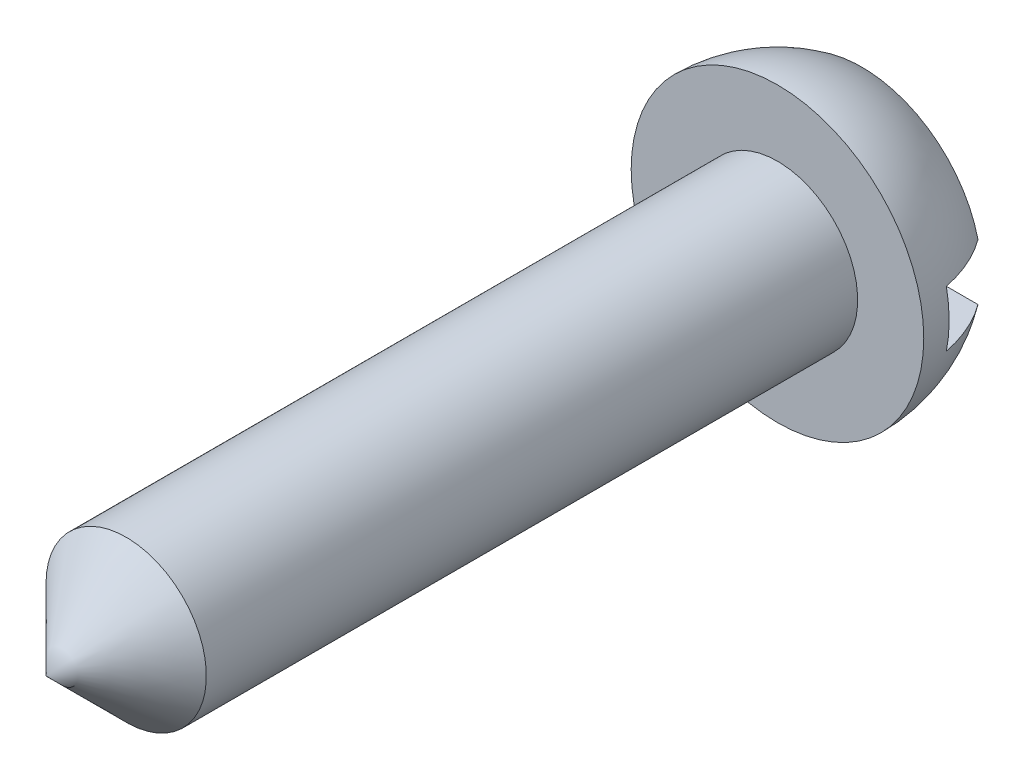
ISO-10303-21;
HEADER;
FILE_DESCRIPTION(('STEP AP214'),'2;1');
FILE_NAME('part.step','',(''),(''),'','','');
FILE_SCHEMA(('AUTOMOTIVE_DESIGN { 1 0 10303 214 1 1 1 1 }'));
ENDSEC;
DATA;
#1=APPLICATION_CONTEXT('core data for automotive mechanical design processes');
#2=APPLICATION_PROTOCOL_DEFINITION('international standard','automotive_design',2000,#1);
#3=PRODUCT_CONTEXT('',#1,'mechanical');
#4=PRODUCT('Part','Part','',(#3));
#5=PRODUCT_RELATED_PRODUCT_CATEGORY('part','',(#4));
#6=PRODUCT_DEFINITION_FORMATION('','',#4);
#7=PRODUCT_DEFINITION_CONTEXT('part definition',#1,'design');
#8=PRODUCT_DEFINITION('design','',#6,#7);
#9=PRODUCT_DEFINITION_SHAPE('','',#8);
#10=(LENGTH_UNIT() NAMED_UNIT(*) SI_UNIT(.MILLI.,.METRE.));
#11=(NAMED_UNIT(*) PLANE_ANGLE_UNIT() SI_UNIT($,.RADIAN.));
#12=(NAMED_UNIT(*) SI_UNIT($,.STERADIAN.) SOLID_ANGLE_UNIT());
#13=UNCERTAINTY_MEASURE_WITH_UNIT(LENGTH_MEASURE(1.E-05),#10,'distance_accuracy_value','');
#14=(GEOMETRIC_REPRESENTATION_CONTEXT(3) GLOBAL_UNCERTAINTY_ASSIGNED_CONTEXT((#13)) GLOBAL_UNIT_ASSIGNED_CONTEXT((#10,
#11,#12)) REPRESENTATION_CONTEXT('',''));
#15=CARTESIAN_POINT('',(0.,0.,0.));
#16=DIRECTION('',(0.,0.,1.));
#17=DIRECTION('',(1.,0.,0.));
#18=AXIS2_PLACEMENT_3D('',#15,#16,#17);
#19=CARTESIAN_POINT('',(0.,0.,-1.5));
#20=DIRECTION('',(0.,0.,1.));
#21=DIRECTION('',(1.,0.,0.));
#22=AXIS2_PLACEMENT_3D('',#19,#20,#21);
#23=PLANE('',#22);
#24=CARTESIAN_POINT('',(0.,0.,-1.5));
#25=DIRECTION('',(0.,0.,-1.));
#26=DIRECTION('',(-1.,0.,0.));
#27=AXIS2_PLACEMENT_3D('',#24,#25,#26);
#28=CIRCLE('',#27,2.12367605815953);
#29=CARTESIAN_POINT('',(2.06397674405503,-0.5,-1.5));
#30=VERTEX_POINT('',#29);
#31=CARTESIAN_POINT('',(-2.06397674405503,-0.5,-1.5));
#32=VERTEX_POINT('',#31);
#33=EDGE_CURVE('E97',#30,#32,#28,.T.);
#34=ORIENTED_EDGE('',*,*,#33,.T.);
#35=DIRECTION('',(1.,0.,0.));
#36=VECTOR('',#35,1.);
#37=CARTESIAN_POINT('',(0.,-0.5,-1.5));
#38=LINE('',#37,#36);
#39=EDGE_CURVE('E83',#32,#30,#38,.T.);
#40=ORIENTED_EDGE('',*,*,#39,.T.);
#41=EDGE_LOOP('',(#34,#40));
#42=FACE_BOUND('',#41,.T.);
#43=ADVANCED_FACE('F37',(#42),#23,.F.);
#44=CARTESIAN_POINT('',(0.,0.,13.));
#45=DIRECTION('',(0.,0.,-1.));
#46=DIRECTION('',(-1.,0.,0.));
#47=AXIS2_PLACEMENT_3D('',#44,#45,#46);
#48=CONICAL_SURFACE('',#47,0.,0.785398163397448);
#49=CARTESIAN_POINT('',(0.,0.,11.575));
#50=DIRECTION('',(0.,0.,-1.));
#51=DIRECTION('',(-1.,0.,0.));
#52=AXIS2_PLACEMENT_3D('',#49,#50,#51);
#53=CIRCLE('',#52,1.425);
#54=CARTESIAN_POINT('',(-1.425,0.,11.575));
#55=VERTEX_POINT('',#54);
#56=EDGE_CURVE('E84',#55,#55,#53,.T.);
#57=ORIENTED_EDGE('',*,*,#56,.F.);
#58=EDGE_LOOP('',(#57));
#59=FACE_BOUND('',#58,.T.);
#60=CARTESIAN_POINT('',(0.,0.,13.));
#61=VERTEX_POINT('',#60);
#62=VERTEX_LOOP('',#61);
#63=FACE_BOUND('',#62,.T.);
#64=ADVANCED_FACE('F39',(#59,#63),#48,.T.);
#65=CARTESIAN_POINT('',(0.,0.,0.));
#66=DIRECTION('',(0.,0.,-1.));
#67=DIRECTION('',(-1.,0.,0.));
#68=AXIS2_PLACEMENT_3D('',#65,#66,#67);
#69=CYLINDRICAL_SURFACE('',#68,1.425);
#70=CARTESIAN_POINT('',(0.,0.,0.));
#71=DIRECTION('',(0.,0.,-1.));
#72=DIRECTION('',(-1.,0.,0.));
#73=AXIS2_PLACEMENT_3D('',#70,#71,#72);
#74=CIRCLE('',#73,1.425);
#75=CARTESIAN_POINT('',(-1.425,0.,0.));
#76=VERTEX_POINT('',#75);
#77=EDGE_CURVE('E100',#76,#76,#74,.T.);
#78=ORIENTED_EDGE('',*,*,#77,.F.);
#79=EDGE_LOOP('',(#78));
#80=FACE_BOUND('',#79,.T.);
#81=ORIENTED_EDGE('',*,*,#56,.T.);
#82=EDGE_LOOP('',(#81));
#83=FACE_BOUND('',#82,.T.);
#84=ADVANCED_FACE('F127',(#80,#83),#69,.T.);
#85=CARTESIAN_POINT('',(1.425,0.,0.));
#86=DIRECTION('',(0.,0.,-1.));
#87=DIRECTION('',(-1.,0.,0.));
#88=AXIS2_PLACEMENT_3D('',#85,#86,#87);
#89=PLANE('',#88);
#90=CARTESIAN_POINT('',(0.,0.,0.));
#91=DIRECTION('',(0.,0.,-1.));
#92=DIRECTION('',(-1.,0.,0.));
#93=AXIS2_PLACEMENT_3D('',#90,#91,#92);
#94=CIRCLE('',#93,2.6);
#95=CARTESIAN_POINT('',(-2.6,0.,0.));
#96=VERTEX_POINT('',#95);
#97=EDGE_CURVE('E96',#96,#96,#94,.T.);
#98=ORIENTED_EDGE('',*,*,#97,.F.);
#99=EDGE_LOOP('',(#98));
#100=FACE_BOUND('',#99,.T.);
#101=ORIENTED_EDGE('',*,*,#77,.T.);
#102=EDGE_LOOP('',(#101));
#103=FACE_BOUND('',#102,.T.);
#104=ADVANCED_FACE('F138',(#100,#103),#89,.F.);
#105=CARTESIAN_POINT('',(0.,0.,0.));
#106=DIRECTION('',(0.,0.,-1.));
#107=DIRECTION('',(1.,0.,0.));
#108=AXIS2_PLACEMENT_3D('',#105,#106,#107);
#109=SPHERICAL_SURFACE('',#108,2.6);
#110=ORIENTED_EDGE('',*,*,#33,.F.);
#111=CARTESIAN_POINT('',(0.,-0.5,0.));
#112=DIRECTION('',(0.,-1.,0.));
#113=DIRECTION('',(0.,0.,-1.));
#114=AXIS2_PLACEMENT_3D('',#111,#112,#113);
#115=CIRCLE('',#114,2.55147016443461);
#116=CARTESIAN_POINT('',(2.50199920063936,-0.5,-0.5));
#117=VERTEX_POINT('',#116);
#118=EDGE_CURVE('E103',#30,#117,#115,.T.);
#119=ORIENTED_EDGE('',*,*,#118,.T.);
#120=CARTESIAN_POINT('',(0.,0.,-0.5));
#121=DIRECTION('',(0.,0.,-1.));
#122=DIRECTION('',(-1.,0.,0.));
#123=AXIS2_PLACEMENT_3D('',#120,#121,#122);
#124=CIRCLE('',#123,2.55147016443461);
#125=CARTESIAN_POINT('',(2.50199920063936,0.5,-0.5));
#126=VERTEX_POINT('',#125);
#127=EDGE_CURVE('E11',#126,#117,#124,.T.);
#128=ORIENTED_EDGE('',*,*,#127,.F.);
#129=CARTESIAN_POINT('',(0.,0.5,0.));
#130=DIRECTION('',(0.,1.,0.));
#131=DIRECTION('',(0.,0.,1.));
#132=AXIS2_PLACEMENT_3D('',#129,#130,#131);
#133=CIRCLE('',#132,2.55147016443461);
#134=CARTESIAN_POINT('',(2.06397674405503,0.5,-1.5));
#135=VERTEX_POINT('',#134);
#136=EDGE_CURVE('E78',#126,#135,#133,.T.);
#137=ORIENTED_EDGE('',*,*,#136,.T.);
#138=CARTESIAN_POINT('',(-2.06397674405503,0.5,-1.5));
#139=VERTEX_POINT('',#138);
#140=EDGE_CURVE('E91',#139,#135,#28,.T.);
#141=ORIENTED_EDGE('',*,*,#140,.F.);
#142=CARTESIAN_POINT('',(-2.50199920063936,0.5,-0.5));
#143=VERTEX_POINT('',#142);
#144=EDGE_CURVE('E52',#139,#143,#133,.T.);
#145=ORIENTED_EDGE('',*,*,#144,.T.);
#146=CARTESIAN_POINT('',(-2.50199920063936,-0.5,-0.5));
#147=VERTEX_POINT('',#146);
#148=EDGE_CURVE('E41',#147,#143,#124,.T.);
#149=ORIENTED_EDGE('',*,*,#148,.F.);
#150=EDGE_CURVE('E93',#147,#32,#115,.T.);
#151=ORIENTED_EDGE('',*,*,#150,.T.);
#152=EDGE_LOOP('',(#110,#119,#128,#137,#141,#145,#149,#151));
#153=FACE_BOUND('',#152,.T.);
#154=ORIENTED_EDGE('',*,*,#97,.T.);
#155=EDGE_LOOP('',(#154));
#156=FACE_BOUND('',#155,.T.);
#157=ADVANCED_FACE('F89',(#153,#156),#109,.T.);
#158=ORIENTED_EDGE('',*,*,#140,.T.);
#159=DIRECTION('',(-1.,0.,0.));
#160=VECTOR('',#159,1.);
#161=CARTESIAN_POINT('',(0.,0.5,-1.5));
#162=LINE('',#161,#160);
#163=EDGE_CURVE('E75',#135,#139,#162,.T.);
#164=ORIENTED_EDGE('',*,*,#163,.T.);
#165=EDGE_LOOP('',(#158,#164));
#166=FACE_BOUND('',#165,.T.);
#167=ADVANCED_FACE('F95',(#166),#23,.F.);
#168=CARTESIAN_POINT('',(0.,0.,-0.5));
#169=DIRECTION('',(0.,0.,-1.));
#170=DIRECTION('',(-1.,0.,0.));
#171=AXIS2_PLACEMENT_3D('',#168,#169,#170);
#172=PLANE('',#171);
#173=ORIENTED_EDGE('',*,*,#127,.T.);
#174=DIRECTION('',(-1.,0.,0.));
#175=VECTOR('',#174,1.);
#176=CARTESIAN_POINT('',(2.94743340453793,-0.5,-0.5));
#177=LINE('',#176,#175);
#178=EDGE_CURVE('E117',#117,#147,#177,.T.);
#179=ORIENTED_EDGE('',*,*,#178,.T.);
#180=ORIENTED_EDGE('',*,*,#148,.T.);
#181=DIRECTION('',(1.,0.,0.));
#182=VECTOR('',#181,1.);
#183=CARTESIAN_POINT('',(2.94743340453793,0.5,-0.5));
#184=LINE('',#183,#182);
#185=EDGE_CURVE('E115',#143,#126,#184,.T.);
#186=ORIENTED_EDGE('',*,*,#185,.T.);
#187=EDGE_LOOP('',(#173,#179,#180,#186));
#188=FACE_BOUND('',#187,.T.);
#189=ADVANCED_FACE('F114',(#188),#172,.T.);
#190=CARTESIAN_POINT('',(2.94743340453793,-0.5,-0.5));
#191=DIRECTION('',(0.,-1.,0.));
#192=DIRECTION('',(0.,0.,-1.));
#193=AXIS2_PLACEMENT_3D('',#190,#191,#192);
#194=PLANE('',#193);
#195=ORIENTED_EDGE('',*,*,#39,.F.);
#196=ORIENTED_EDGE('',*,*,#150,.F.);
#197=ORIENTED_EDGE('',*,*,#178,.F.);
#198=ORIENTED_EDGE('',*,*,#118,.F.);
#199=EDGE_LOOP('',(#195,#196,#197,#198));
#200=FACE_BOUND('',#199,.T.);
#201=ADVANCED_FACE('F136',(#200),#194,.F.);
#202=CARTESIAN_POINT('',(2.94743340453793,0.5,-0.5));
#203=DIRECTION('',(0.,1.,0.));
#204=DIRECTION('',(0.,0.,1.));
#205=AXIS2_PLACEMENT_3D('',#202,#203,#204);
#206=PLANE('',#205);
#207=ORIENTED_EDGE('',*,*,#185,.F.);
#208=ORIENTED_EDGE('',*,*,#144,.F.);
#209=ORIENTED_EDGE('',*,*,#163,.F.);
#210=ORIENTED_EDGE('',*,*,#136,.F.);
#211=EDGE_LOOP('',(#207,#208,#209,#210));
#212=FACE_BOUND('',#211,.T.);
#213=ADVANCED_FACE('F77',(#212),#206,.F.);
#214=CLOSED_SHELL('',(#43,#64,#84,#104,#157,#167,#189,#201,#213));
#215=MANIFOLD_SOLID_BREP('B2',#214);
#216=ADVANCED_BREP_SHAPE_REPRESENTATION('',(#18,#215),#14);
#217=SHAPE_DEFINITION_REPRESENTATION(#9,#216);
ENDSEC;
END-ISO-10303-21;
